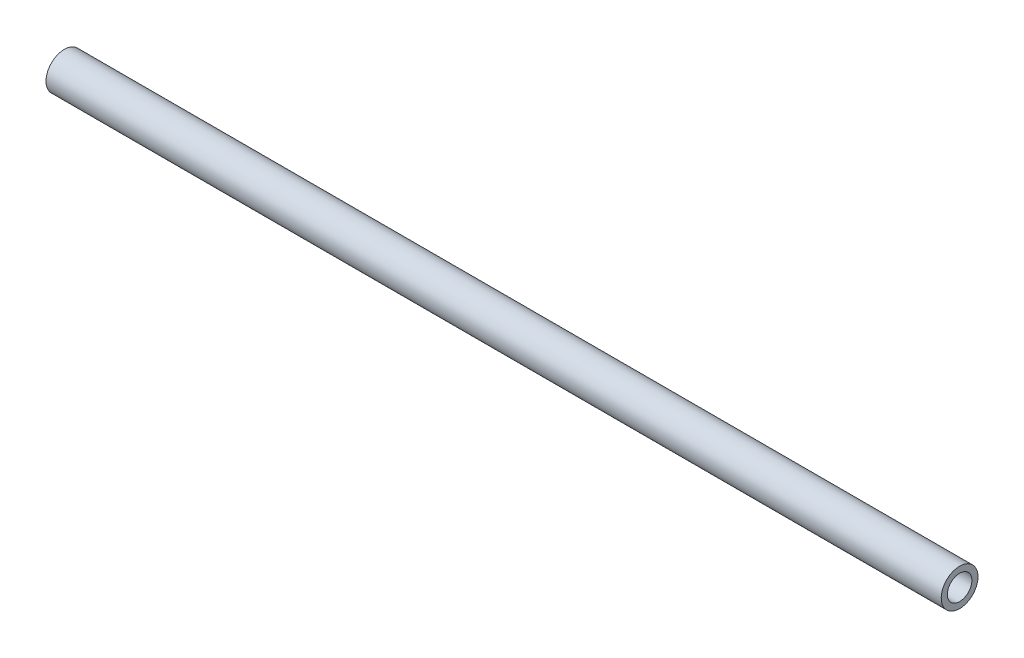
ISO-10303-21;
HEADER;
FILE_DESCRIPTION(('STEP AP214'),'2;1');
FILE_NAME('part.step','',(''),(''),'','','');
FILE_SCHEMA(('AUTOMOTIVE_DESIGN { 1 0 10303 214 1 1 1 1 }'));
ENDSEC;
DATA;
#1=APPLICATION_CONTEXT('core data for automotive mechanical design processes');
#2=APPLICATION_PROTOCOL_DEFINITION('international standard','automotive_design',2000,#1);
#3=PRODUCT_CONTEXT('',#1,'mechanical');
#4=PRODUCT('Part','Part','',(#3));
#5=PRODUCT_RELATED_PRODUCT_CATEGORY('part','',(#4));
#6=PRODUCT_DEFINITION_FORMATION('','',#4);
#7=PRODUCT_DEFINITION_CONTEXT('part definition',#1,'design');
#8=PRODUCT_DEFINITION('design','',#6,#7);
#9=PRODUCT_DEFINITION_SHAPE('','',#8);
#10=(LENGTH_UNIT() NAMED_UNIT(*) SI_UNIT(.MILLI.,.METRE.));
#11=(NAMED_UNIT(*) PLANE_ANGLE_UNIT() SI_UNIT($,.RADIAN.));
#12=(NAMED_UNIT(*) SI_UNIT($,.STERADIAN.) SOLID_ANGLE_UNIT());
#13=UNCERTAINTY_MEASURE_WITH_UNIT(LENGTH_MEASURE(1.E-05),#10,'distance_accuracy_value','');
#14=(GEOMETRIC_REPRESENTATION_CONTEXT(3) GLOBAL_UNCERTAINTY_ASSIGNED_CONTEXT((#13)) GLOBAL_UNIT_ASSIGNED_CONTEXT((#10,
#11,#12)) REPRESENTATION_CONTEXT('',''));
#15=CARTESIAN_POINT('',(0.,0.,0.));
#16=DIRECTION('',(0.,0.,1.));
#17=DIRECTION('',(1.,0.,0.));
#18=AXIS2_PLACEMENT_3D('',#15,#16,#17);
#19=CARTESIAN_POINT('',(-231.775,0.,0.));
#20=DIRECTION('',(1.,0.,0.));
#21=DIRECTION('',(0.,1.,0.));
#22=AXIS2_PLACEMENT_3D('',#19,#20,#21);
#23=CYLINDRICAL_SURFACE('',#22,6.35);
#24=CARTESIAN_POINT('',(-231.775,0.,0.));
#25=DIRECTION('',(-1.,0.,0.));
#26=DIRECTION('',(0.,-1.,0.));
#27=AXIS2_PLACEMENT_3D('',#24,#25,#26);
#28=CIRCLE('',#27,6.35);
#29=CARTESIAN_POINT('',(-231.775,-6.35000000000006,0.));
#30=VERTEX_POINT('',#29);
#31=EDGE_CURVE('E45',#30,#30,#28,.T.);
#32=ORIENTED_EDGE('',*,*,#31,.T.);
#33=EDGE_LOOP('',(#32));
#34=FACE_BOUND('',#33,.T.);
#35=CARTESIAN_POINT('',(231.775,0.,0.));
#36=DIRECTION('',(-1.,0.,0.));
#37=DIRECTION('',(0.,-1.,0.));
#38=AXIS2_PLACEMENT_3D('',#35,#36,#37);
#39=CIRCLE('',#38,6.35);
#40=CARTESIAN_POINT('',(231.775,-6.34999999999991,0.));
#41=VERTEX_POINT('',#40);
#42=EDGE_CURVE('E51',#41,#41,#39,.T.);
#43=ORIENTED_EDGE('',*,*,#42,.F.);
#44=EDGE_LOOP('',(#43));
#45=FACE_BOUND('',#44,.T.);
#46=ADVANCED_FACE('F38',(#34,#45),#23,.F.);
#47=CARTESIAN_POINT('',(-231.775,0.,0.));
#48=DIRECTION('',(1.,0.,0.));
#49=DIRECTION('',(0.,1.,0.));
#50=AXIS2_PLACEMENT_3D('',#47,#48,#49);
#51=CYLINDRICAL_SURFACE('',#50,9.525);
#52=CARTESIAN_POINT('',(-231.775,0.,0.));
#53=DIRECTION('',(-1.,0.,0.));
#54=DIRECTION('',(0.,-1.,0.));
#55=AXIS2_PLACEMENT_3D('',#52,#53,#54);
#56=CIRCLE('',#55,9.525);
#57=CARTESIAN_POINT('',(-231.775,-9.52500000000006,0.));
#58=VERTEX_POINT('',#57);
#59=EDGE_CURVE('E11',#58,#58,#56,.T.);
#60=ORIENTED_EDGE('',*,*,#59,.F.);
#61=EDGE_LOOP('',(#60));
#62=FACE_BOUND('',#61,.T.);
#63=CARTESIAN_POINT('',(231.775,0.,0.));
#64=DIRECTION('',(-1.,0.,0.));
#65=DIRECTION('',(0.,-1.,0.));
#66=AXIS2_PLACEMENT_3D('',#63,#64,#65);
#67=CIRCLE('',#66,9.525);
#68=CARTESIAN_POINT('',(231.775,-9.52499999999992,0.));
#69=VERTEX_POINT('',#68);
#70=EDGE_CURVE('E41',#69,#69,#67,.T.);
#71=ORIENTED_EDGE('',*,*,#70,.T.);
#72=EDGE_LOOP('',(#71));
#73=FACE_BOUND('',#72,.T.);
#74=ADVANCED_FACE('F58',(#62,#73),#51,.T.);
#75=CARTESIAN_POINT('',(-231.775,0.,0.));
#76=DIRECTION('',(-1.,0.,0.));
#77=DIRECTION('',(0.,-1.,0.));
#78=AXIS2_PLACEMENT_3D('',#75,#76,#77);
#79=PLANE('',#78);
#80=ORIENTED_EDGE('',*,*,#31,.F.);
#81=EDGE_LOOP('',(#80));
#82=FACE_BOUND('',#81,.T.);
#83=ORIENTED_EDGE('',*,*,#59,.T.);
#84=EDGE_LOOP('',(#83));
#85=FACE_BOUND('',#84,.T.);
#86=ADVANCED_FACE('F62',(#82,#85),#79,.T.);
#87=CARTESIAN_POINT('',(231.775,0.,0.));
#88=DIRECTION('',(-1.,0.,0.));
#89=DIRECTION('',(0.,-1.,0.));
#90=AXIS2_PLACEMENT_3D('',#87,#88,#89);
#91=PLANE('',#90);
#92=ORIENTED_EDGE('',*,*,#42,.T.);
#93=EDGE_LOOP('',(#92));
#94=FACE_BOUND('',#93,.T.);
#95=ORIENTED_EDGE('',*,*,#70,.F.);
#96=EDGE_LOOP('',(#95));
#97=FACE_BOUND('',#96,.T.);
#98=ADVANCED_FACE('F60',(#94,#97),#91,.F.);
#99=CLOSED_SHELL('',(#46,#74,#86,#98));
#100=MANIFOLD_SOLID_BREP('B2',#99);
#101=ADVANCED_BREP_SHAPE_REPRESENTATION('',(#18,#100),#14);
#102=SHAPE_DEFINITION_REPRESENTATION(#9,#101);
ENDSEC;
END-ISO-10303-21;
